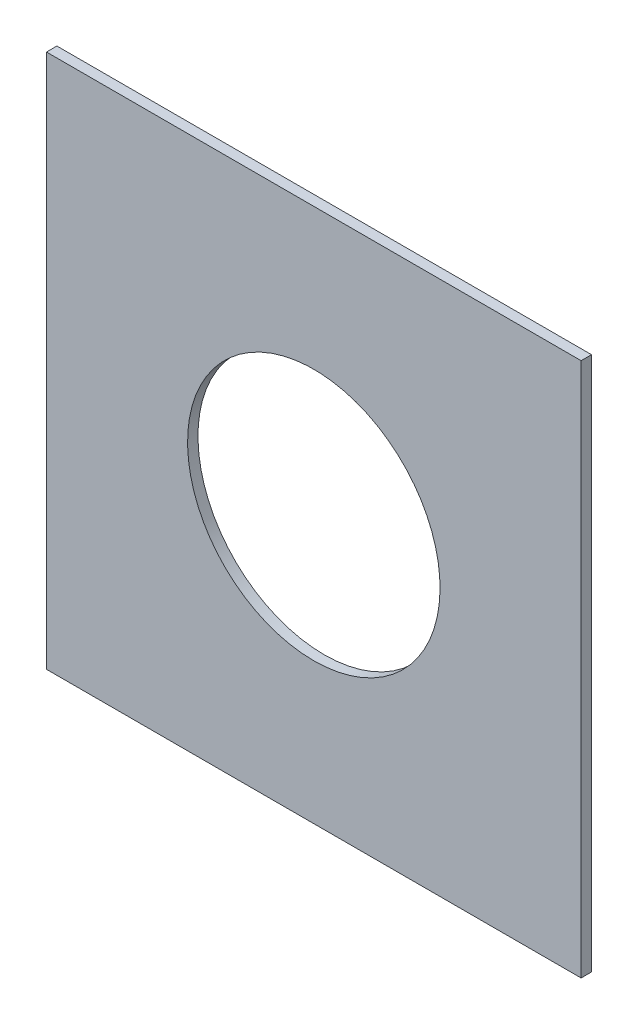
ISO-10303-21;
HEADER;
FILE_DESCRIPTION(('STEP AP214'),'2;1');
FILE_NAME('part.step','',(''),(''),'','','');
FILE_SCHEMA(('AUTOMOTIVE_DESIGN { 1 0 10303 214 1 1 1 1 }'));
ENDSEC;
DATA;
#1=APPLICATION_CONTEXT('core data for automotive mechanical design processes');
#2=APPLICATION_PROTOCOL_DEFINITION('international standard','automotive_design',2000,#1);
#3=PRODUCT_CONTEXT('',#1,'mechanical');
#4=PRODUCT('Part','Part','',(#3));
#5=PRODUCT_RELATED_PRODUCT_CATEGORY('part','',(#4));
#6=PRODUCT_DEFINITION_FORMATION('','',#4);
#7=PRODUCT_DEFINITION_CONTEXT('part definition',#1,'design');
#8=PRODUCT_DEFINITION('design','',#6,#7);
#9=PRODUCT_DEFINITION_SHAPE('','',#8);
#10=(LENGTH_UNIT() NAMED_UNIT(*) SI_UNIT(.MILLI.,.METRE.));
#11=(NAMED_UNIT(*) PLANE_ANGLE_UNIT() SI_UNIT($,.RADIAN.));
#12=(NAMED_UNIT(*) SI_UNIT($,.STERADIAN.) SOLID_ANGLE_UNIT());
#13=UNCERTAINTY_MEASURE_WITH_UNIT(LENGTH_MEASURE(1.E-05),#10,'distance_accuracy_value','');
#14=(GEOMETRIC_REPRESENTATION_CONTEXT(3) GLOBAL_UNCERTAINTY_ASSIGNED_CONTEXT((#13)) GLOBAL_UNIT_ASSIGNED_CONTEXT((#10,
#11,#12)) REPRESENTATION_CONTEXT('',''));
#15=CARTESIAN_POINT('',(0.,0.,0.));
#16=DIRECTION('',(0.,0.,1.));
#17=DIRECTION('',(1.,0.,0.));
#18=AXIS2_PLACEMENT_3D('',#15,#16,#17);
#19=CARTESIAN_POINT('',(172.8978,-71.2108,-0.045));
#20=DIRECTION('',(0.,0.,-1.));
#21=DIRECTION('',(0.,-1.,0.));
#22=AXIS2_PLACEMENT_3D('',#19,#20,#21);
#23=CYLINDRICAL_SURFACE('',#22,0.425);
#24=CARTESIAN_POINT('',(172.8978,-71.2108,1.67));
#25=DIRECTION('',(0.,0.,-1.));
#26=DIRECTION('',(0.,-1.,0.));
#27=AXIS2_PLACEMENT_3D('',#24,#25,#26);
#28=CIRCLE('',#27,0.425);
#29=CARTESIAN_POINT('',(172.8978,-71.6358,1.67));
#30=VERTEX_POINT('',#29);
#31=EDGE_CURVE('E125',#30,#30,#28,.T.);
#32=ORIENTED_EDGE('',*,*,#31,.T.);
#33=DIRECTION('',(0.,0.,1.));
#34=VECTOR('',#33,1.);
#35=CARTESIAN_POINT('',(172.8978,-71.6358,-0.045));
#36=LINE('',#35,#34);
#37=CARTESIAN_POINT('',(172.8978,-71.6358,1.705));
#38=VERTEX_POINT('',#37);
#39=EDGE_CURVE('E11',#30,#38,#36,.T.);
#40=ORIENTED_EDGE('',*,*,#39,.T.);
#41=CARTESIAN_POINT('',(172.8978,-71.2108,1.705));
#42=DIRECTION('',(0.,0.,-1.));
#43=DIRECTION('',(0.,-1.,0.));
#44=AXIS2_PLACEMENT_3D('',#41,#42,#43);
#45=CIRCLE('',#44,0.425);
#46=EDGE_CURVE('E27',#38,#38,#45,.T.);
#47=ORIENTED_EDGE('',*,*,#46,.F.);
#48=ORIENTED_EDGE('',*,*,#39,.F.);
#49=EDGE_LOOP('',(#32,#40,#47,#48));
#50=FACE_BOUND('',#49,.T.);
#51=ADVANCED_FACE('F17',(#50),#23,.F.);
#52=CARTESIAN_POINT('',(171.9978,-70.3108,1.67));
#53=DIRECTION('',(0.,1.,0.));
#54=DIRECTION('',(1.,0.,0.));
#55=AXIS2_PLACEMENT_3D('',#52,#53,#54);
#56=PLANE('',#55);
#57=DIRECTION('',(0.,0.,1.));
#58=VECTOR('',#57,1.);
#59=CARTESIAN_POINT('',(171.9978,-70.3108,1.67));
#60=LINE('',#59,#58);
#61=CARTESIAN_POINT('',(171.9978,-70.3108,1.67));
#62=VERTEX_POINT('',#61);
#63=CARTESIAN_POINT('',(171.9978,-70.3108,1.705));
#64=VERTEX_POINT('',#63);
#65=EDGE_CURVE('E132',#62,#64,#60,.T.);
#66=ORIENTED_EDGE('',*,*,#65,.T.);
#67=DIRECTION('',(1.,0.,0.));
#68=VECTOR('',#67,1.);
#69=CARTESIAN_POINT('',(171.9978,-70.3108,1.705));
#70=LINE('',#69,#68);
#71=CARTESIAN_POINT('',(173.7978,-70.3108,1.705));
#72=VERTEX_POINT('',#71);
#73=EDGE_CURVE('E20',#64,#72,#70,.T.);
#74=ORIENTED_EDGE('',*,*,#73,.T.);
#75=DIRECTION('',(0.,0.,1.));
#76=VECTOR('',#75,1.);
#77=CARTESIAN_POINT('',(173.7978,-70.3108,1.67));
#78=LINE('',#77,#76);
#79=CARTESIAN_POINT('',(173.7978,-70.3108,1.67));
#80=VERTEX_POINT('',#79);
#81=EDGE_CURVE('E95',#80,#72,#78,.T.);
#82=ORIENTED_EDGE('',*,*,#81,.F.);
#83=DIRECTION('',(1.,0.,0.));
#84=VECTOR('',#83,1.);
#85=CARTESIAN_POINT('',(171.9978,-70.3108,1.67));
#86=LINE('',#85,#84);
#87=EDGE_CURVE('E67',#62,#80,#86,.T.);
#88=ORIENTED_EDGE('',*,*,#87,.F.);
#89=EDGE_LOOP('',(#66,#74,#82,#88));
#90=FACE_BOUND('',#89,.T.);
#91=ADVANCED_FACE('F148',(#90),#56,.T.);
#92=CARTESIAN_POINT('',(0.,0.,1.705));
#93=DIRECTION('',(0.,0.,1.));
#94=DIRECTION('',(1.,0.,0.));
#95=AXIS2_PLACEMENT_3D('',#92,#93,#94);
#96=PLANE('',#95);
#97=ORIENTED_EDGE('',*,*,#46,.T.);
#98=EDGE_LOOP('',(#97));
#99=FACE_BOUND('',#98,.T.);
#100=DIRECTION('',(-1.,0.,0.));
#101=VECTOR('',#100,1.);
#102=CARTESIAN_POINT('',(173.7978,-72.1108,1.705));
#103=LINE('',#102,#101);
#104=CARTESIAN_POINT('',(173.7978,-72.1108,1.705));
#105=VERTEX_POINT('',#104);
#106=CARTESIAN_POINT('',(171.9978,-72.1108,1.705));
#107=VERTEX_POINT('',#106);
#108=EDGE_CURVE('E99',#105,#107,#103,.T.);
#109=ORIENTED_EDGE('',*,*,#108,.F.);
#110=DIRECTION('',(0.,-1.,0.));
#111=VECTOR('',#110,1.);
#112=CARTESIAN_POINT('',(173.7978,-70.3108,1.705));
#113=LINE('',#112,#111);
#114=EDGE_CURVE('E90',#72,#105,#113,.T.);
#115=ORIENTED_EDGE('',*,*,#114,.F.);
#116=ORIENTED_EDGE('',*,*,#73,.F.);
#117=DIRECTION('',(0.,1.,0.));
#118=VECTOR('',#117,1.);
#119=CARTESIAN_POINT('',(171.9978,-72.1108,1.705));
#120=LINE('',#119,#118);
#121=EDGE_CURVE('E102',#107,#64,#120,.T.);
#122=ORIENTED_EDGE('',*,*,#121,.F.);
#123=EDGE_LOOP('',(#109,#115,#116,#122));
#124=FACE_BOUND('',#123,.T.);
#125=ADVANCED_FACE('F100',(#99,#124),#96,.T.);
#126=CARTESIAN_POINT('',(0.,0.,1.67));
#127=DIRECTION('',(0.,0.,1.));
#128=DIRECTION('',(1.,0.,0.));
#129=AXIS2_PLACEMENT_3D('',#126,#127,#128);
#130=PLANE('',#129);
#131=ORIENTED_EDGE('',*,*,#31,.F.);
#132=EDGE_LOOP('',(#131));
#133=FACE_BOUND('',#132,.T.);
#134=DIRECTION('',(0.,1.,0.));
#135=VECTOR('',#134,1.);
#136=CARTESIAN_POINT('',(171.9978,-72.1108,1.67));
#137=LINE('',#136,#135);
#138=CARTESIAN_POINT('',(171.9978,-72.1108,1.67));
#139=VERTEX_POINT('',#138);
#140=EDGE_CURVE('E126',#139,#62,#137,.T.);
#141=ORIENTED_EDGE('',*,*,#140,.T.);
#142=ORIENTED_EDGE('',*,*,#87,.T.);
#143=DIRECTION('',(0.,-1.,0.));
#144=VECTOR('',#143,1.);
#145=CARTESIAN_POINT('',(173.7978,-70.3108,1.67));
#146=LINE('',#145,#144);
#147=CARTESIAN_POINT('',(173.7978,-72.1108,1.67));
#148=VERTEX_POINT('',#147);
#149=EDGE_CURVE('E83',#80,#148,#146,.T.);
#150=ORIENTED_EDGE('',*,*,#149,.T.);
#151=DIRECTION('',(-1.,0.,0.));
#152=VECTOR('',#151,1.);
#153=CARTESIAN_POINT('',(173.7978,-72.1108,1.67));
#154=LINE('',#153,#152);
#155=EDGE_CURVE('E110',#148,#139,#154,.T.);
#156=ORIENTED_EDGE('',*,*,#155,.T.);
#157=EDGE_LOOP('',(#141,#142,#150,#156));
#158=FACE_BOUND('',#157,.T.);
#159=ADVANCED_FACE('F158',(#133,#158),#130,.F.);
#160=CARTESIAN_POINT('',(171.9978,-72.1108,1.67));
#161=DIRECTION('',(-1.,0.,0.));
#162=DIRECTION('',(0.,0.,1.));
#163=AXIS2_PLACEMENT_3D('',#160,#161,#162);
#164=PLANE('',#163);
#165=DIRECTION('',(0.,0.,1.));
#166=VECTOR('',#165,1.);
#167=CARTESIAN_POINT('',(171.9978,-72.1108,1.67));
#168=LINE('',#167,#166);
#169=EDGE_CURVE('E107',#139,#107,#168,.T.);
#170=ORIENTED_EDGE('',*,*,#169,.T.);
#171=ORIENTED_EDGE('',*,*,#121,.T.);
#172=ORIENTED_EDGE('',*,*,#65,.F.);
#173=ORIENTED_EDGE('',*,*,#140,.F.);
#174=EDGE_LOOP('',(#170,#171,#172,#173));
#175=FACE_BOUND('',#174,.T.);
#176=ADVANCED_FACE('F163',(#175),#164,.T.);
#177=CARTESIAN_POINT('',(173.7978,-70.3108,1.67));
#178=DIRECTION('',(1.,0.,0.));
#179=DIRECTION('',(0.,1.,0.));
#180=AXIS2_PLACEMENT_3D('',#177,#178,#179);
#181=PLANE('',#180);
#182=ORIENTED_EDGE('',*,*,#81,.T.);
#183=ORIENTED_EDGE('',*,*,#114,.T.);
#184=DIRECTION('',(0.,0.,1.));
#185=VECTOR('',#184,1.);
#186=CARTESIAN_POINT('',(173.7978,-72.1108,1.67));
#187=LINE('',#186,#185);
#188=EDGE_CURVE('E94',#148,#105,#187,.T.);
#189=ORIENTED_EDGE('',*,*,#188,.F.);
#190=ORIENTED_EDGE('',*,*,#149,.F.);
#191=EDGE_LOOP('',(#182,#183,#189,#190));
#192=FACE_BOUND('',#191,.T.);
#193=ADVANCED_FACE('F92',(#192),#181,.T.);
#194=CARTESIAN_POINT('',(173.7978,-72.1108,1.67));
#195=DIRECTION('',(0.,-1.,0.));
#196=DIRECTION('',(0.,0.,-1.));
#197=AXIS2_PLACEMENT_3D('',#194,#195,#196);
#198=PLANE('',#197);
#199=ORIENTED_EDGE('',*,*,#188,.T.);
#200=ORIENTED_EDGE('',*,*,#108,.T.);
#201=ORIENTED_EDGE('',*,*,#169,.F.);
#202=ORIENTED_EDGE('',*,*,#155,.F.);
#203=EDGE_LOOP('',(#199,#200,#201,#202));
#204=FACE_BOUND('',#203,.T.);
#205=ADVANCED_FACE('F109',(#204),#198,.T.);
#206=CLOSED_SHELL('',(#51,#91,#125,#159,#176,#193,#205));
#207=MANIFOLD_SOLID_BREP('B1',#206);
#208=ADVANCED_BREP_SHAPE_REPRESENTATION('',(#18,#207),#14);
#209=SHAPE_DEFINITION_REPRESENTATION(#9,#208);
ENDSEC;
END-ISO-10303-21;
